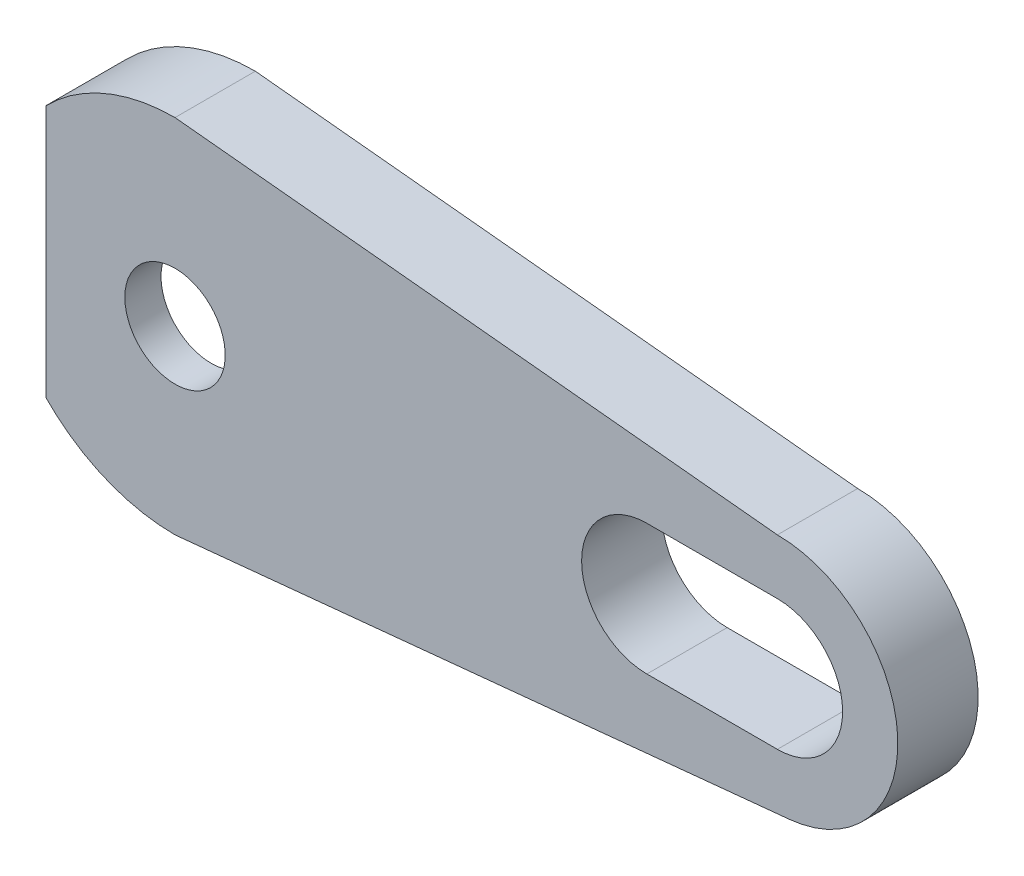
ISO-10303-21;
HEADER;
FILE_DESCRIPTION(('STEP AP214'),'2;1');
FILE_NAME('part.step','',(''),(''),'','','');
FILE_SCHEMA(('AUTOMOTIVE_DESIGN { 1 0 10303 214 1 1 1 1 }'));
ENDSEC;
DATA;
#1=APPLICATION_CONTEXT('core data for automotive mechanical design processes');
#2=APPLICATION_PROTOCOL_DEFINITION('international standard','automotive_design',2000,#1);
#3=PRODUCT_CONTEXT('',#1,'mechanical');
#4=PRODUCT('Part','Part','',(#3));
#5=PRODUCT_RELATED_PRODUCT_CATEGORY('part','',(#4));
#6=PRODUCT_DEFINITION_FORMATION('','',#4);
#7=PRODUCT_DEFINITION_CONTEXT('part definition',#1,'design');
#8=PRODUCT_DEFINITION('design','',#6,#7);
#9=PRODUCT_DEFINITION_SHAPE('','',#8);
#10=(LENGTH_UNIT() NAMED_UNIT(*) SI_UNIT(.MILLI.,.METRE.));
#11=(NAMED_UNIT(*) PLANE_ANGLE_UNIT() SI_UNIT($,.RADIAN.));
#12=(NAMED_UNIT(*) SI_UNIT($,.STERADIAN.) SOLID_ANGLE_UNIT());
#13=UNCERTAINTY_MEASURE_WITH_UNIT(LENGTH_MEASURE(1.E-05),#10,'distance_accuracy_value','');
#14=(GEOMETRIC_REPRESENTATION_CONTEXT(3) GLOBAL_UNCERTAINTY_ASSIGNED_CONTEXT((#13)) GLOBAL_UNIT_ASSIGNED_CONTEXT((#10,
#11,#12)) REPRESENTATION_CONTEXT('',''));
#15=CARTESIAN_POINT('',(0.,0.,0.));
#16=DIRECTION('',(0.,0.,1.));
#17=DIRECTION('',(1.,0.,0.));
#18=AXIS2_PLACEMENT_3D('',#15,#16,#17);
#19=CARTESIAN_POINT('',(0.,0.,4.));
#20=DIRECTION('',(0.,0.,-1.));
#21=DIRECTION('',(-1.,0.,0.));
#22=AXIS2_PLACEMENT_3D('',#19,#20,#21);
#23=PLANE('',#22);
#24=DIRECTION('',(1.,0.,0.));
#25=VECTOR('',#24,1.);
#26=CARTESIAN_POINT('',(23.5,-3.25,4.));
#27=LINE('',#26,#25);
#28=CARTESIAN_POINT('',(23.5,-3.25,4.));
#29=VERTEX_POINT('',#28);
#30=CARTESIAN_POINT('',(30.,-3.25,4.));
#31=VERTEX_POINT('',#30);
#32=EDGE_CURVE('E271',#29,#31,#27,.T.);
#33=ORIENTED_EDGE('',*,*,#32,.F.);
#34=CARTESIAN_POINT('',(23.5,0.,4.));
#35=DIRECTION('',(0.,0.,1.));
#36=DIRECTION('',(1.,0.,0.));
#37=AXIS2_PLACEMENT_3D('',#34,#35,#36);
#38=CIRCLE('',#37,3.25);
#39=CARTESIAN_POINT('',(23.5,3.25,4.));
#40=VERTEX_POINT('',#39);
#41=EDGE_CURVE('E259',#40,#29,#38,.T.);
#42=ORIENTED_EDGE('',*,*,#41,.F.);
#43=DIRECTION('',(-1.,0.,0.));
#44=VECTOR('',#43,1.);
#45=CARTESIAN_POINT('',(23.5,3.25,4.));
#46=LINE('',#45,#44);
#47=CARTESIAN_POINT('',(30.,3.25,4.));
#48=VERTEX_POINT('',#47);
#49=EDGE_CURVE('E255',#48,#40,#46,.T.);
#50=ORIENTED_EDGE('',*,*,#49,.F.);
#51=CARTESIAN_POINT('',(30.,0.,4.));
#52=DIRECTION('',(0.,0.,1.));
#53=DIRECTION('',(-1.,0.,0.));
#54=AXIS2_PLACEMENT_3D('',#51,#52,#53);
#55=CIRCLE('',#54,3.25);
#56=EDGE_CURVE('E269',#31,#48,#55,.T.);
#57=ORIENTED_EDGE('',*,*,#56,.F.);
#58=EDGE_LOOP('',(#33,#42,#50,#57));
#59=FACE_BOUND('',#58,.T.);
#60=DIRECTION('',(0.995133097794459,0.0985399293383375,0.));
#61=VECTOR('',#60,1.);
#62=CARTESIAN_POINT('',(0.,-9.,4.));
#63=LINE('',#62,#61);
#64=CARTESIAN_POINT('',(0.,-9.,4.));
#65=VERTEX_POINT('',#64);
#66=CARTESIAN_POINT('',(30.59123957603,-5.97079858676675,4.));
#67=VERTEX_POINT('',#66);
#68=EDGE_CURVE('E242',#65,#67,#63,.T.);
#69=ORIENTED_EDGE('',*,*,#68,.T.);
#70=CARTESIAN_POINT('',(30.,0.,4.));
#71=DIRECTION('',(0.,0.,1.));
#72=DIRECTION('',(-1.,0.,0.));
#73=AXIS2_PLACEMENT_3D('',#70,#71,#72);
#74=CIRCLE('',#73,6.);
#75=CARTESIAN_POINT('',(30.,6.,4.));
#76=VERTEX_POINT('',#75);
#77=EDGE_CURVE('E240',#67,#76,#74,.T.);
#78=ORIENTED_EDGE('',*,*,#77,.T.);
#79=DIRECTION('',(-0.995037190209989,0.0995037190209989,0.));
#80=VECTOR('',#79,1.);
#81=CARTESIAN_POINT('',(0.,9.,4.));
#82=LINE('',#81,#80);
#83=CARTESIAN_POINT('',(0.,9.,4.));
#84=VERTEX_POINT('',#83);
#85=EDGE_CURVE('E206',#76,#84,#82,.T.);
#86=ORIENTED_EDGE('',*,*,#85,.T.);
#87=CARTESIAN_POINT('',(0.,0.,4.));
#88=DIRECTION('',(0.,0.,1.));
#89=DIRECTION('',(-1.,0.,0.));
#90=AXIS2_PLACEMENT_3D('',#87,#88,#89);
#91=CIRCLE('',#90,9.);
#92=CARTESIAN_POINT('',(-6.42654307097902,6.30075742723457,4.));
#93=VERTEX_POINT('',#92);
#94=EDGE_CURVE('E210',#84,#93,#91,.T.);
#95=ORIENTED_EDGE('',*,*,#94,.T.);
#96=DIRECTION('',(0.,1.,0.));
#97=VECTOR('',#96,1.);
#98=CARTESIAN_POINT('',(-6.42654307097901,-6.30075742723457,4.));
#99=LINE('',#98,#97);
#100=CARTESIAN_POINT('',(-6.42654307097901,-6.30075742723457,4.));
#101=VERTEX_POINT('',#100);
#102=EDGE_CURVE('E159',#101,#93,#99,.T.);
#103=ORIENTED_EDGE('',*,*,#102,.F.);
#104=CARTESIAN_POINT('',(0.,0.,4.));
#105=DIRECTION('',(0.,0.,1.));
#106=DIRECTION('',(1.,0.,0.));
#107=AXIS2_PLACEMENT_3D('',#104,#105,#106);
#108=CIRCLE('',#107,9.);
#109=EDGE_CURVE('E244',#101,#65,#108,.T.);
#110=ORIENTED_EDGE('',*,*,#109,.T.);
#111=EDGE_LOOP('',(#69,#78,#86,#95,#103,#110));
#112=FACE_BOUND('',#111,.T.);
#113=CARTESIAN_POINT('',(0.,0.,4.));
#114=DIRECTION('',(0.,0.,-1.));
#115=DIRECTION('',(-1.,0.,0.));
#116=AXIS2_PLACEMENT_3D('',#113,#114,#115);
#117=CIRCLE('',#116,2.5);
#118=CARTESIAN_POINT('',(-2.5,0.,4.));
#119=VERTEX_POINT('',#118);
#120=EDGE_CURVE('E290',#119,#119,#117,.T.);
#121=ORIENTED_EDGE('',*,*,#120,.T.);
#122=EDGE_LOOP('',(#121));
#123=FACE_BOUND('',#122,.T.);
#124=ADVANCED_FACE('F34',(#59,#112,#123),#23,.F.);
#125=CARTESIAN_POINT('',(0.,0.,0.));
#126=DIRECTION('',(0.,0.,-1.));
#127=DIRECTION('',(-1.,0.,0.));
#128=AXIS2_PLACEMENT_3D('',#125,#126,#127);
#129=PLANE('',#128);
#130=CARTESIAN_POINT('',(0.,0.,0.));
#131=DIRECTION('',(0.,0.,1.));
#132=DIRECTION('',(-1.,0.,0.));
#133=AXIS2_PLACEMENT_3D('',#130,#131,#132);
#134=CIRCLE('',#133,9.);
#135=CARTESIAN_POINT('',(0.,9.,0.));
#136=VERTEX_POINT('',#135);
#137=CARTESIAN_POINT('',(-6.42654307097901,6.30075742723457,0.));
#138=VERTEX_POINT('',#137);
#139=EDGE_CURVE('E178',#136,#138,#134,.T.);
#140=ORIENTED_EDGE('',*,*,#139,.F.);
#141=DIRECTION('',(-0.995037190209989,0.0995037190209989,0.));
#142=VECTOR('',#141,1.);
#143=CARTESIAN_POINT('',(0.,9.,0.));
#144=LINE('',#143,#142);
#145=CARTESIAN_POINT('',(30.,6.,0.));
#146=VERTEX_POINT('',#145);
#147=EDGE_CURVE('E207',#146,#136,#144,.T.);
#148=ORIENTED_EDGE('',*,*,#147,.F.);
#149=CARTESIAN_POINT('',(30.,0.,0.));
#150=DIRECTION('',(0.,0.,1.));
#151=DIRECTION('',(-1.,0.,0.));
#152=AXIS2_PLACEMENT_3D('',#149,#150,#151);
#153=CIRCLE('',#152,6.);
#154=CARTESIAN_POINT('',(30.59123957603,-5.97079858676675,0.));
#155=VERTEX_POINT('',#154);
#156=EDGE_CURVE('E211',#155,#146,#153,.T.);
#157=ORIENTED_EDGE('',*,*,#156,.F.);
#158=DIRECTION('',(0.995133097794459,0.0985399293383375,0.));
#159=VECTOR('',#158,1.);
#160=CARTESIAN_POINT('',(0.,-9.,0.));
#161=LINE('',#160,#159);
#162=CARTESIAN_POINT('',(0.,-9.,0.));
#163=VERTEX_POINT('',#162);
#164=EDGE_CURVE('E213',#163,#155,#161,.T.);
#165=ORIENTED_EDGE('',*,*,#164,.F.);
#166=CARTESIAN_POINT('',(0.,0.,0.));
#167=DIRECTION('',(0.,0.,1.));
#168=DIRECTION('',(1.,0.,0.));
#169=AXIS2_PLACEMENT_3D('',#166,#167,#168);
#170=CIRCLE('',#169,9.);
#171=CARTESIAN_POINT('',(-6.42654307097901,-6.30075742723457,0.));
#172=VERTEX_POINT('',#171);
#173=EDGE_CURVE('E215',#172,#163,#170,.T.);
#174=ORIENTED_EDGE('',*,*,#173,.F.);
#175=DIRECTION('',(-0.707106781186548,-0.707106781186548,0.));
#176=VECTOR('',#175,1.);
#177=CARTESIAN_POINT('',(-4.37578564374445,-4.25,0.));
#178=LINE('',#177,#176);
#179=CARTESIAN_POINT('',(-4.37578564374444,-4.25,0.));
#180=VERTEX_POINT('',#179);
#181=EDGE_CURVE('E218',#180,#172,#178,.T.);
#182=ORIENTED_EDGE('',*,*,#181,.F.);
#183=CARTESIAN_POINT('',(0.,0.,0.));
#184=DIRECTION('',(0.,0.,-1.));
#185=DIRECTION('',(-1.,0.,0.));
#186=AXIS2_PLACEMENT_3D('',#183,#184,#185);
#187=CIRCLE('',#186,6.1);
#188=CARTESIAN_POINT('',(4.37578564374445,-4.25,0.));
#189=VERTEX_POINT('',#188);
#190=EDGE_CURVE('E221',#189,#180,#187,.T.);
#191=ORIENTED_EDGE('',*,*,#190,.F.);
#192=DIRECTION('',(-0.993627549913592,-0.112713317991759,0.));
#193=VECTOR('',#192,1.);
#194=CARTESIAN_POINT('',(17.3155972903769,-2.78215713975806,0.));
#195=LINE('',#194,#193);
#196=CARTESIAN_POINT('',(17.3155972903769,-2.78215713975806,0.));
#197=VERTEX_POINT('',#196);
#198=EDGE_CURVE('E224',#197,#189,#195,.T.);
#199=ORIENTED_EDGE('',*,*,#198,.F.);
#200=CARTESIAN_POINT('',(17.,0.,0.));
#201=DIRECTION('',(0.,0.,-1.));
#202=DIRECTION('',(1.,0.,0.));
#203=AXIS2_PLACEMENT_3D('',#200,#201,#202);
#204=CIRCLE('',#203,2.8);
#205=CARTESIAN_POINT('',(17.3155972903769,2.78215713975806,0.));
#206=VERTEX_POINT('',#205);
#207=EDGE_CURVE('E227',#206,#197,#204,.T.);
#208=ORIENTED_EDGE('',*,*,#207,.F.);
#209=DIRECTION('',(0.993627549913592,-0.112713317991759,0.));
#210=VECTOR('',#209,1.);
#211=CARTESIAN_POINT('',(4.37578564374445,4.25,0.));
#212=LINE('',#211,#210);
#213=CARTESIAN_POINT('',(4.37578564374445,4.25,0.));
#214=VERTEX_POINT('',#213);
#215=EDGE_CURVE('E230',#214,#206,#212,.T.);
#216=ORIENTED_EDGE('',*,*,#215,.F.);
#217=CARTESIAN_POINT('',(0.,0.,0.));
#218=DIRECTION('',(0.,0.,-1.));
#219=DIRECTION('',(1.,0.,0.));
#220=AXIS2_PLACEMENT_3D('',#217,#218,#219);
#221=CIRCLE('',#220,6.1);
#222=CARTESIAN_POINT('',(-4.37578564374445,4.25,0.));
#223=VERTEX_POINT('',#222);
#224=EDGE_CURVE('E233',#223,#214,#221,.T.);
#225=ORIENTED_EDGE('',*,*,#224,.F.);
#226=DIRECTION('',(0.707106781186548,-0.707106781186548,0.));
#227=VECTOR('',#226,1.);
#228=CARTESIAN_POINT('',(-4.37578564374445,4.25,0.));
#229=LINE('',#228,#227);
#230=EDGE_CURVE('E235',#138,#223,#229,.T.);
#231=ORIENTED_EDGE('',*,*,#230,.F.);
#232=EDGE_LOOP('',(#140,#148,#157,#165,#174,#182,#191,#199,#208,#216,#225,#231));
#233=FACE_BOUND('',#232,.T.);
#234=DIRECTION('',(-1.,0.,0.));
#235=VECTOR('',#234,1.);
#236=CARTESIAN_POINT('',(23.5,3.25,0.));
#237=LINE('',#236,#235);
#238=CARTESIAN_POINT('',(30.,3.25,0.));
#239=VERTEX_POINT('',#238);
#240=CARTESIAN_POINT('',(23.5,3.25,0.));
#241=VERTEX_POINT('',#240);
#242=EDGE_CURVE('E256',#239,#241,#237,.T.);
#243=ORIENTED_EDGE('',*,*,#242,.T.);
#244=CARTESIAN_POINT('',(23.5,0.,0.));
#245=DIRECTION('',(0.,0.,1.));
#246=DIRECTION('',(1.,0.,0.));
#247=AXIS2_PLACEMENT_3D('',#244,#245,#246);
#248=CIRCLE('',#247,3.25);
#249=CARTESIAN_POINT('',(23.5,-3.25,0.));
#250=VERTEX_POINT('',#249);
#251=EDGE_CURVE('E173',#241,#250,#248,.T.);
#252=ORIENTED_EDGE('',*,*,#251,.T.);
#253=DIRECTION('',(1.,0.,0.));
#254=VECTOR('',#253,1.);
#255=CARTESIAN_POINT('',(23.5,-3.25,0.));
#256=LINE('',#255,#254);
#257=CARTESIAN_POINT('',(30.,-3.25,0.));
#258=VERTEX_POINT('',#257);
#259=EDGE_CURVE('E263',#250,#258,#256,.T.);
#260=ORIENTED_EDGE('',*,*,#259,.T.);
#261=CARTESIAN_POINT('',(30.,0.,0.));
#262=DIRECTION('',(0.,0.,1.));
#263=DIRECTION('',(-1.,0.,0.));
#264=AXIS2_PLACEMENT_3D('',#261,#262,#263);
#265=CIRCLE('',#264,3.25);
#266=EDGE_CURVE('E260',#258,#239,#265,.T.);
#267=ORIENTED_EDGE('',*,*,#266,.T.);
#268=EDGE_LOOP('',(#243,#252,#260,#267));
#269=FACE_BOUND('',#268,.T.);
#270=ADVANCED_FACE('F310',(#233,#269),#129,.T.);
#271=CARTESIAN_POINT('',(0.,0.,4.));
#272=DIRECTION('',(0.,0.,-1.));
#273=DIRECTION('',(-1.,0.,0.));
#274=AXIS2_PLACEMENT_3D('',#271,#272,#273);
#275=CYLINDRICAL_SURFACE('',#274,9.);
#276=DIRECTION('',(0.,0.,-1.));
#277=VECTOR('',#276,1.);
#278=CARTESIAN_POINT('',(-6.42654307097901,6.30075742723457,4.));
#279=LINE('',#278,#277);
#280=CARTESIAN_POINT('',(-6.42654307097902,6.30075742723457,2.2));
#281=VERTEX_POINT('',#280);
#282=EDGE_CURVE('E42',#281,#138,#279,.T.);
#283=ORIENTED_EDGE('',*,*,#282,.F.);
#284=EDGE_CURVE('E11',#93,#281,#279,.T.);
#285=ORIENTED_EDGE('',*,*,#284,.F.);
#286=ORIENTED_EDGE('',*,*,#94,.F.);
#287=DIRECTION('',(0.,0.,-1.));
#288=VECTOR('',#287,1.);
#289=CARTESIAN_POINT('',(0.,9.,4.));
#290=LINE('',#289,#288);
#291=EDGE_CURVE('E204',#84,#136,#290,.T.);
#292=ORIENTED_EDGE('',*,*,#291,.T.);
#293=ORIENTED_EDGE('',*,*,#139,.T.);
#294=EDGE_LOOP('',(#283,#285,#286,#292,#293));
#295=FACE_BOUND('',#294,.T.);
#296=ADVANCED_FACE('F36',(#295),#275,.T.);
#297=CARTESIAN_POINT('',(-4.37578564374445,4.25,4.));
#298=DIRECTION('',(0.707106781186547,0.707106781186547,0.));
#299=DIRECTION('',(-0.707106781186548,0.707106781186548,0.));
#300=AXIS2_PLACEMENT_3D('',#297,#298,#299);
#301=PLANE('',#300);
#302=DIRECTION('',(0.,0.,-1.));
#303=VECTOR('',#302,1.);
#304=CARTESIAN_POINT('',(-4.37578564374445,4.25,4.));
#305=LINE('',#304,#303);
#306=CARTESIAN_POINT('',(-4.37578564374445,4.25,2.2));
#307=VERTEX_POINT('',#306);
#308=EDGE_CURVE('E172',#307,#223,#305,.T.);
#309=ORIENTED_EDGE('',*,*,#308,.F.);
#310=DIRECTION('',(-0.707106781186548,0.707106781186548,0.));
#311=VECTOR('',#310,1.);
#312=CARTESIAN_POINT('',(-4.37578564374445,4.25,2.2));
#313=LINE('',#312,#311);
#314=EDGE_CURVE('E154',#307,#281,#313,.T.);
#315=ORIENTED_EDGE('',*,*,#314,.T.);
#316=ORIENTED_EDGE('',*,*,#282,.T.);
#317=ORIENTED_EDGE('',*,*,#230,.T.);
#318=EDGE_LOOP('',(#309,#315,#316,#317));
#319=FACE_BOUND('',#318,.T.);
#320=ADVANCED_FACE('F169',(#319),#301,.F.);
#321=CARTESIAN_POINT('',(0.,0.,4.));
#322=DIRECTION('',(0.,0.,-1.));
#323=DIRECTION('',(-1.,0.,0.));
#324=AXIS2_PLACEMENT_3D('',#321,#322,#323);
#325=CYLINDRICAL_SURFACE('',#324,6.1);
#326=DIRECTION('',(0.,0.,-1.));
#327=VECTOR('',#326,1.);
#328=CARTESIAN_POINT('',(4.37578564374445,4.25,4.));
#329=LINE('',#328,#327);
#330=CARTESIAN_POINT('',(4.37578564374445,4.25,2.2));
#331=VERTEX_POINT('',#330);
#332=EDGE_CURVE('E179',#331,#214,#329,.T.);
#333=ORIENTED_EDGE('',*,*,#332,.F.);
#334=CARTESIAN_POINT('',(0.,0.,2.2));
#335=DIRECTION('',(0.,0.,-1.));
#336=DIRECTION('',(-1.,0.,0.));
#337=AXIS2_PLACEMENT_3D('',#334,#335,#336);
#338=CIRCLE('',#337,6.1);
#339=EDGE_CURVE('E174',#331,#307,#338,.F.);
#340=ORIENTED_EDGE('',*,*,#339,.T.);
#341=ORIENTED_EDGE('',*,*,#308,.T.);
#342=ORIENTED_EDGE('',*,*,#224,.T.);
#343=EDGE_LOOP('',(#333,#340,#341,#342));
#344=FACE_BOUND('',#343,.T.);
#345=ADVANCED_FACE('F359',(#344),#325,.F.);
#346=CARTESIAN_POINT('',(4.37578564374445,4.25,4.));
#347=DIRECTION('',(0.112713317991759,0.993627549913592,0.));
#348=DIRECTION('',(-0.993627549913592,0.112713317991759,0.));
#349=AXIS2_PLACEMENT_3D('',#346,#347,#348);
#350=PLANE('',#349);
#351=DIRECTION('',(0.,0.,-1.));
#352=VECTOR('',#351,1.);
#353=CARTESIAN_POINT('',(17.3155972903769,2.78215713975806,4.));
#354=LINE('',#353,#352);
#355=CARTESIAN_POINT('',(17.3155972903769,2.78215713975806,2.2));
#356=VERTEX_POINT('',#355);
#357=EDGE_CURVE('E182',#356,#206,#354,.T.);
#358=ORIENTED_EDGE('',*,*,#357,.F.);
#359=DIRECTION('',(-0.993627549913592,0.112713317991759,0.));
#360=VECTOR('',#359,1.);
#361=CARTESIAN_POINT('',(4.37578564374445,4.25,2.2));
#362=LINE('',#361,#360);
#363=EDGE_CURVE('E275',#356,#331,#362,.T.);
#364=ORIENTED_EDGE('',*,*,#363,.T.);
#365=ORIENTED_EDGE('',*,*,#332,.T.);
#366=ORIENTED_EDGE('',*,*,#215,.T.);
#367=EDGE_LOOP('',(#358,#364,#365,#366));
#368=FACE_BOUND('',#367,.T.);
#369=ADVANCED_FACE('F355',(#368),#350,.F.);
#370=CARTESIAN_POINT('',(17.,0.,4.));
#371=DIRECTION('',(0.,0.,-1.));
#372=DIRECTION('',(-1.,0.,0.));
#373=AXIS2_PLACEMENT_3D('',#370,#371,#372);
#374=CYLINDRICAL_SURFACE('',#373,2.8);
#375=DIRECTION('',(0.,0.,-1.));
#376=VECTOR('',#375,1.);
#377=CARTESIAN_POINT('',(17.3155972903769,-2.78215713975806,4.));
#378=LINE('',#377,#376);
#379=CARTESIAN_POINT('',(17.3155972903769,-2.78215713975806,2.2));
#380=VERTEX_POINT('',#379);
#381=EDGE_CURVE('E186',#380,#197,#378,.T.);
#382=ORIENTED_EDGE('',*,*,#381,.F.);
#383=CARTESIAN_POINT('',(17.,0.,2.2));
#384=DIRECTION('',(0.,0.,-1.));
#385=DIRECTION('',(-1.,0.,0.));
#386=AXIS2_PLACEMENT_3D('',#383,#384,#385);
#387=CIRCLE('',#386,2.8);
#388=EDGE_CURVE('E278',#380,#356,#387,.F.);
#389=ORIENTED_EDGE('',*,*,#388,.T.);
#390=ORIENTED_EDGE('',*,*,#357,.T.);
#391=ORIENTED_EDGE('',*,*,#207,.T.);
#392=EDGE_LOOP('',(#382,#389,#390,#391));
#393=FACE_BOUND('',#392,.T.);
#394=ADVANCED_FACE('F351',(#393),#374,.F.);
#395=CARTESIAN_POINT('',(17.3155972903769,-2.78215713975806,4.));
#396=DIRECTION('',(0.112713317991759,-0.993627549913592,0.));
#397=DIRECTION('',(0.993627549913592,0.112713317991759,0.));
#398=AXIS2_PLACEMENT_3D('',#395,#396,#397);
#399=PLANE('',#398);
#400=DIRECTION('',(0.,0.,-1.));
#401=VECTOR('',#400,1.);
#402=CARTESIAN_POINT('',(4.37578564374445,-4.25,4.));
#403=LINE('',#402,#401);
#404=CARTESIAN_POINT('',(4.37578564374445,-4.25,2.2));
#405=VERTEX_POINT('',#404);
#406=EDGE_CURVE('E188',#405,#189,#403,.T.);
#407=ORIENTED_EDGE('',*,*,#406,.F.);
#408=DIRECTION('',(0.993627549913592,0.112713317991759,0.));
#409=VECTOR('',#408,1.);
#410=CARTESIAN_POINT('',(17.3155972903769,-2.78215713975806,2.2));
#411=LINE('',#410,#409);
#412=EDGE_CURVE('E281',#405,#380,#411,.T.);
#413=ORIENTED_EDGE('',*,*,#412,.T.);
#414=ORIENTED_EDGE('',*,*,#381,.T.);
#415=ORIENTED_EDGE('',*,*,#198,.T.);
#416=EDGE_LOOP('',(#407,#413,#414,#415));
#417=FACE_BOUND('',#416,.T.);
#418=ADVANCED_FACE('F347',(#417),#399,.F.);
#419=CARTESIAN_POINT('',(0.,0.,4.));
#420=DIRECTION('',(0.,0.,-1.));
#421=DIRECTION('',(-1.,0.,0.));
#422=AXIS2_PLACEMENT_3D('',#419,#420,#421);
#423=CYLINDRICAL_SURFACE('',#422,6.1);
#424=DIRECTION('',(0.,0.,-1.));
#425=VECTOR('',#424,1.);
#426=CARTESIAN_POINT('',(-4.37578564374444,-4.25,4.));
#427=LINE('',#426,#425);
#428=CARTESIAN_POINT('',(-4.37578564374445,-4.25,2.2));
#429=VERTEX_POINT('',#428);
#430=EDGE_CURVE('E190',#429,#180,#427,.T.);
#431=ORIENTED_EDGE('',*,*,#430,.F.);
#432=CARTESIAN_POINT('',(0.,0.,2.2));
#433=DIRECTION('',(0.,0.,-1.));
#434=DIRECTION('',(-1.,0.,0.));
#435=AXIS2_PLACEMENT_3D('',#432,#433,#434);
#436=CIRCLE('',#435,6.1);
#437=EDGE_CURVE('E284',#429,#405,#436,.F.);
#438=ORIENTED_EDGE('',*,*,#437,.T.);
#439=ORIENTED_EDGE('',*,*,#406,.T.);
#440=ORIENTED_EDGE('',*,*,#190,.T.);
#441=EDGE_LOOP('',(#431,#438,#439,#440));
#442=FACE_BOUND('',#441,.T.);
#443=ADVANCED_FACE('F343',(#442),#423,.F.);
#444=CARTESIAN_POINT('',(-4.37578564374445,-4.25,4.));
#445=DIRECTION('',(0.707106781186547,-0.707106781186547,0.));
#446=DIRECTION('',(0.707106781186548,0.707106781186548,0.));
#447=AXIS2_PLACEMENT_3D('',#444,#445,#446);
#448=PLANE('',#447);
#449=DIRECTION('',(0.,0.,-1.));
#450=VECTOR('',#449,1.);
#451=CARTESIAN_POINT('',(-6.42654307097901,-6.30075742723457,4.));
#452=LINE('',#451,#450);
#453=CARTESIAN_POINT('',(-6.42654307097901,-6.30075742723457,2.2));
#454=VERTEX_POINT('',#453);
#455=EDGE_CURVE('E195',#454,#172,#452,.T.);
#456=ORIENTED_EDGE('',*,*,#455,.F.);
#457=DIRECTION('',(0.707106781186548,0.707106781186548,0.));
#458=VECTOR('',#457,1.);
#459=CARTESIAN_POINT('',(-4.37578564374445,-4.25,2.2));
#460=LINE('',#459,#458);
#461=EDGE_CURVE('E157',#454,#429,#460,.T.);
#462=ORIENTED_EDGE('',*,*,#461,.T.);
#463=ORIENTED_EDGE('',*,*,#430,.T.);
#464=ORIENTED_EDGE('',*,*,#181,.T.);
#465=EDGE_LOOP('',(#456,#462,#463,#464));
#466=FACE_BOUND('',#465,.T.);
#467=ADVANCED_FACE('F339',(#466),#448,.F.);
#468=CARTESIAN_POINT('',(0.,0.,4.));
#469=DIRECTION('',(0.,0.,-1.));
#470=DIRECTION('',(-1.,0.,0.));
#471=AXIS2_PLACEMENT_3D('',#468,#469,#470);
#472=CYLINDRICAL_SURFACE('',#471,9.);
#473=ORIENTED_EDGE('',*,*,#173,.T.);
#474=DIRECTION('',(0.,0.,-1.));
#475=VECTOR('',#474,1.);
#476=CARTESIAN_POINT('',(0.,-9.,4.));
#477=LINE('',#476,#475);
#478=EDGE_CURVE('E196',#65,#163,#477,.T.);
#479=ORIENTED_EDGE('',*,*,#478,.F.);
#480=ORIENTED_EDGE('',*,*,#109,.F.);
#481=EDGE_CURVE('E192',#101,#454,#452,.T.);
#482=ORIENTED_EDGE('',*,*,#481,.T.);
#483=ORIENTED_EDGE('',*,*,#455,.T.);
#484=EDGE_LOOP('',(#473,#479,#480,#482,#483));
#485=FACE_BOUND('',#484,.T.);
#486=ADVANCED_FACE('F335',(#485),#472,.T.);
#487=CARTESIAN_POINT('',(0.,-9.,4.));
#488=DIRECTION('',(-0.0985399293383375,0.995133097794459,0.));
#489=DIRECTION('',(-0.995133097794459,-0.0985399293383375,0.));
#490=AXIS2_PLACEMENT_3D('',#487,#488,#489);
#491=PLANE('',#490);
#492=ORIENTED_EDGE('',*,*,#478,.T.);
#493=ORIENTED_EDGE('',*,*,#164,.T.);
#494=DIRECTION('',(0.,0.,-1.));
#495=VECTOR('',#494,1.);
#496=CARTESIAN_POINT('',(30.59123957603,-5.97079858676675,4.));
#497=LINE('',#496,#495);
#498=EDGE_CURVE('E198',#67,#155,#497,.T.);
#499=ORIENTED_EDGE('',*,*,#498,.F.);
#500=ORIENTED_EDGE('',*,*,#68,.F.);
#501=EDGE_LOOP('',(#492,#493,#499,#500));
#502=FACE_BOUND('',#501,.T.);
#503=ADVANCED_FACE('F331',(#502),#491,.F.);
#504=CARTESIAN_POINT('',(30.,0.,4.));
#505=DIRECTION('',(0.,0.,-1.));
#506=DIRECTION('',(-1.,0.,0.));
#507=AXIS2_PLACEMENT_3D('',#504,#505,#506);
#508=CYLINDRICAL_SURFACE('',#507,6.);
#509=ORIENTED_EDGE('',*,*,#156,.T.);
#510=DIRECTION('',(0.,0.,-1.));
#511=VECTOR('',#510,1.);
#512=CARTESIAN_POINT('',(30.,6.,4.));
#513=LINE('',#512,#511);
#514=EDGE_CURVE('E201',#76,#146,#513,.T.);
#515=ORIENTED_EDGE('',*,*,#514,.F.);
#516=ORIENTED_EDGE('',*,*,#77,.F.);
#517=ORIENTED_EDGE('',*,*,#498,.T.);
#518=EDGE_LOOP('',(#509,#515,#516,#517));
#519=FACE_BOUND('',#518,.T.);
#520=ADVANCED_FACE('F327',(#519),#508,.T.);
#521=CARTESIAN_POINT('',(0.,9.,4.));
#522=DIRECTION('',(-0.0995037190209989,-0.995037190209989,0.));
#523=DIRECTION('',(0.995037190209989,-0.0995037190209989,0.));
#524=AXIS2_PLACEMENT_3D('',#521,#522,#523);
#525=PLANE('',#524);
#526=ORIENTED_EDGE('',*,*,#147,.T.);
#527=ORIENTED_EDGE('',*,*,#291,.F.);
#528=ORIENTED_EDGE('',*,*,#85,.F.);
#529=ORIENTED_EDGE('',*,*,#514,.T.);
#530=EDGE_LOOP('',(#526,#527,#528,#529));
#531=FACE_BOUND('',#530,.T.);
#532=ADVANCED_FACE('F324',(#531),#525,.F.);
#533=CARTESIAN_POINT('',(23.5,0.,4.));
#534=DIRECTION('',(0.,0.,-1.));
#535=DIRECTION('',(-1.,0.,0.));
#536=AXIS2_PLACEMENT_3D('',#533,#534,#535);
#537=CYLINDRICAL_SURFACE('',#536,3.25);
#538=ORIENTED_EDGE('',*,*,#41,.T.);
#539=DIRECTION('',(0.,0.,-1.));
#540=VECTOR('',#539,1.);
#541=CARTESIAN_POINT('',(23.5,-3.25,4.));
#542=LINE('',#541,#540);
#543=EDGE_CURVE('E238',#29,#250,#542,.T.);
#544=ORIENTED_EDGE('',*,*,#543,.T.);
#545=ORIENTED_EDGE('',*,*,#251,.F.);
#546=DIRECTION('',(0.,0.,-1.));
#547=VECTOR('',#546,1.);
#548=CARTESIAN_POINT('',(23.5,3.25,4.));
#549=LINE('',#548,#547);
#550=EDGE_CURVE('E252',#40,#241,#549,.T.);
#551=ORIENTED_EDGE('',*,*,#550,.F.);
#552=EDGE_LOOP('',(#538,#544,#545,#551));
#553=FACE_BOUND('',#552,.T.);
#554=ADVANCED_FACE('F321',(#553),#537,.F.);
#555=CARTESIAN_POINT('',(23.5,-3.25,4.));
#556=DIRECTION('',(0.,1.,0.));
#557=DIRECTION('',(-1.,0.,0.));
#558=AXIS2_PLACEMENT_3D('',#555,#556,#557);
#559=PLANE('',#558);
#560=ORIENTED_EDGE('',*,*,#259,.F.);
#561=ORIENTED_EDGE('',*,*,#543,.F.);
#562=ORIENTED_EDGE('',*,*,#32,.T.);
#563=DIRECTION('',(0.,0.,-1.));
#564=VECTOR('',#563,1.);
#565=CARTESIAN_POINT('',(30.,-3.25,4.));
#566=LINE('',#565,#564);
#567=EDGE_CURVE('E249',#31,#258,#566,.T.);
#568=ORIENTED_EDGE('',*,*,#567,.T.);
#569=EDGE_LOOP('',(#560,#561,#562,#568));
#570=FACE_BOUND('',#569,.T.);
#571=ADVANCED_FACE('F386',(#570),#559,.T.);
#572=CARTESIAN_POINT('',(30.,0.,4.));
#573=DIRECTION('',(0.,0.,-1.));
#574=DIRECTION('',(-1.,0.,0.));
#575=AXIS2_PLACEMENT_3D('',#572,#573,#574);
#576=CYLINDRICAL_SURFACE('',#575,3.25);
#577=ORIENTED_EDGE('',*,*,#266,.F.);
#578=ORIENTED_EDGE('',*,*,#567,.F.);
#579=ORIENTED_EDGE('',*,*,#56,.T.);
#580=DIRECTION('',(0.,0.,-1.));
#581=VECTOR('',#580,1.);
#582=CARTESIAN_POINT('',(30.,3.25,4.));
#583=LINE('',#582,#581);
#584=EDGE_CURVE('E56',#48,#239,#583,.T.);
#585=ORIENTED_EDGE('',*,*,#584,.T.);
#586=EDGE_LOOP('',(#577,#578,#579,#585));
#587=FACE_BOUND('',#586,.T.);
#588=ADVANCED_FACE('F306',(#587),#576,.F.);
#589=CARTESIAN_POINT('',(23.5,3.25,4.));
#590=DIRECTION('',(0.,-1.,0.));
#591=DIRECTION('',(1.,0.,0.));
#592=AXIS2_PLACEMENT_3D('',#589,#590,#591);
#593=PLANE('',#592);
#594=ORIENTED_EDGE('',*,*,#242,.F.);
#595=ORIENTED_EDGE('',*,*,#584,.F.);
#596=ORIENTED_EDGE('',*,*,#49,.T.);
#597=ORIENTED_EDGE('',*,*,#550,.T.);
#598=EDGE_LOOP('',(#594,#595,#596,#597));
#599=FACE_BOUND('',#598,.T.);
#600=ADVANCED_FACE('F299',(#599),#593,.T.);
#601=CARTESIAN_POINT('',(0.,0.,2.2));
#602=DIRECTION('',(0.,0.,-1.));
#603=DIRECTION('',(-1.,0.,0.));
#604=AXIS2_PLACEMENT_3D('',#601,#602,#603);
#605=PLANE('',#604);
#606=ORIENTED_EDGE('',*,*,#314,.F.);
#607=ORIENTED_EDGE('',*,*,#339,.F.);
#608=ORIENTED_EDGE('',*,*,#363,.F.);
#609=ORIENTED_EDGE('',*,*,#388,.F.);
#610=ORIENTED_EDGE('',*,*,#412,.F.);
#611=ORIENTED_EDGE('',*,*,#437,.F.);
#612=ORIENTED_EDGE('',*,*,#461,.F.);
#613=DIRECTION('',(0.,1.,0.));
#614=VECTOR('',#613,1.);
#615=CARTESIAN_POINT('',(-6.42654307097901,-6.30075742723457,2.2));
#616=LINE('',#615,#614);
#617=EDGE_CURVE('E48',#454,#281,#616,.T.);
#618=ORIENTED_EDGE('',*,*,#617,.T.);
#619=EDGE_LOOP('',(#606,#607,#608,#609,#610,#611,#612,#618));
#620=FACE_BOUND('',#619,.T.);
#621=CARTESIAN_POINT('',(0.,0.,2.2));
#622=DIRECTION('',(0.,0.,-1.));
#623=DIRECTION('',(-1.,0.,0.));
#624=AXIS2_PLACEMENT_3D('',#621,#622,#623);
#625=CIRCLE('',#624,2.5);
#626=CARTESIAN_POINT('',(-2.5,0.,2.2));
#627=VERTEX_POINT('',#626);
#628=EDGE_CURVE('E288',#627,#627,#625,.T.);
#629=ORIENTED_EDGE('',*,*,#628,.F.);
#630=EDGE_LOOP('',(#629));
#631=FACE_BOUND('',#630,.T.);
#632=ADVANCED_FACE('F151',(#620,#631),#605,.T.);
#633=CARTESIAN_POINT('',(-6.42654307097901,-6.30075742723457,2.2));
#634=DIRECTION('',(1.,0.,0.));
#635=DIRECTION('',(0.,0.,-1.));
#636=AXIS2_PLACEMENT_3D('',#633,#634,#635);
#637=PLANE('',#636);
#638=ORIENTED_EDGE('',*,*,#102,.T.);
#639=ORIENTED_EDGE('',*,*,#284,.T.);
#640=ORIENTED_EDGE('',*,*,#617,.F.);
#641=ORIENTED_EDGE('',*,*,#481,.F.);
#642=EDGE_LOOP('',(#638,#639,#640,#641));
#643=FACE_BOUND('',#642,.T.);
#644=ADVANCED_FACE('F162',(#643),#637,.F.);
#645=CARTESIAN_POINT('',(0.,0.,2.2));
#646=DIRECTION('',(0.,0.,1.));
#647=DIRECTION('',(1.,0.,0.));
#648=AXIS2_PLACEMENT_3D('',#645,#646,#647);
#649=CYLINDRICAL_SURFACE('',#648,2.5);
#650=ORIENTED_EDGE('',*,*,#628,.T.);
#651=EDGE_LOOP('',(#650));
#652=FACE_BOUND('',#651,.T.);
#653=ORIENTED_EDGE('',*,*,#120,.F.);
#654=EDGE_LOOP('',(#653));
#655=FACE_BOUND('',#654,.T.);
#656=ADVANCED_FACE('F296',(#652,#655),#649,.F.);
#657=CLOSED_SHELL('',(#124,#270,#296,#320,#345,#369,#394,#418,#443,#467,#486,#503,#520,#532,
#554,#571,#588,#600,#632,#644,#656));
#658=MANIFOLD_SOLID_BREP('B2',#657);
#659=ADVANCED_BREP_SHAPE_REPRESENTATION('',(#18,#658),#14);
#660=SHAPE_DEFINITION_REPRESENTATION(#9,#659);
ENDSEC;
END-ISO-10303-21;
